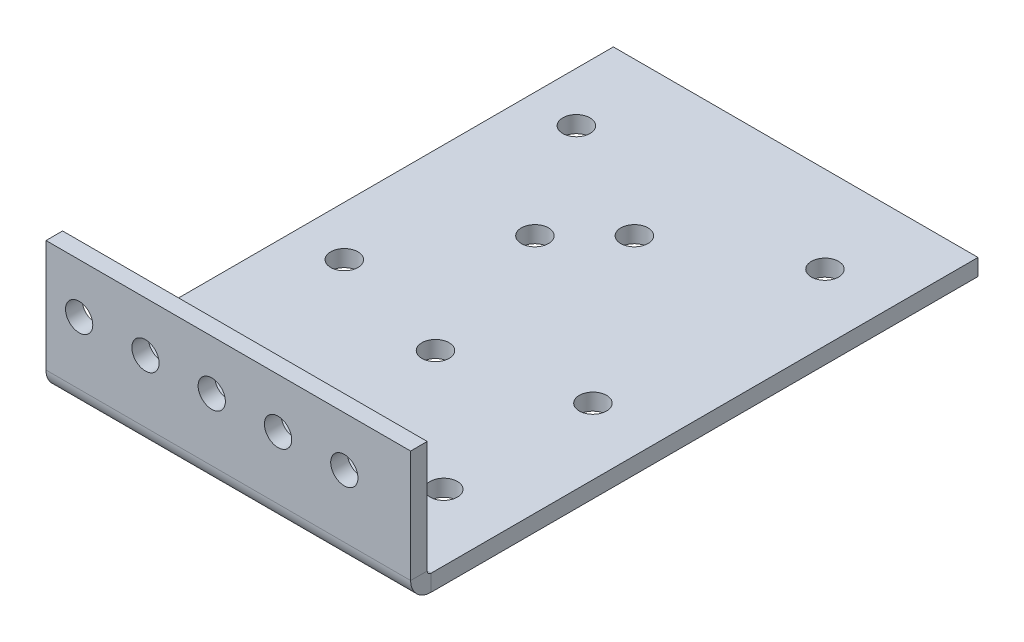
ISO-10303-21;
HEADER;
FILE_DESCRIPTION(('STEP AP214'),'2;1');
FILE_NAME('part.step','',(''),(''),'','','');
FILE_SCHEMA(('AUTOMOTIVE_DESIGN { 1 0 10303 214 1 1 1 1 }'));
ENDSEC;
DATA;
#1=APPLICATION_CONTEXT('core data for automotive mechanical design processes');
#2=APPLICATION_PROTOCOL_DEFINITION('international standard','automotive_design',2000,#1);
#3=PRODUCT_CONTEXT('',#1,'mechanical');
#4=PRODUCT('Part','Part','',(#3));
#5=PRODUCT_RELATED_PRODUCT_CATEGORY('part','',(#4));
#6=PRODUCT_DEFINITION_FORMATION('','',#4);
#7=PRODUCT_DEFINITION_CONTEXT('part definition',#1,'design');
#8=PRODUCT_DEFINITION('design','',#6,#7);
#9=PRODUCT_DEFINITION_SHAPE('','',#8);
#10=(LENGTH_UNIT() NAMED_UNIT(*) SI_UNIT(.MILLI.,.METRE.));
#11=(NAMED_UNIT(*) PLANE_ANGLE_UNIT() SI_UNIT($,.RADIAN.));
#12=(NAMED_UNIT(*) SI_UNIT($,.STERADIAN.) SOLID_ANGLE_UNIT());
#13=UNCERTAINTY_MEASURE_WITH_UNIT(LENGTH_MEASURE(1.E-05),#10,'distance_accuracy_value','');
#14=(GEOMETRIC_REPRESENTATION_CONTEXT(3) GLOBAL_UNCERTAINTY_ASSIGNED_CONTEXT((#13)) GLOBAL_UNIT_ASSIGNED_CONTEXT((#10,
#11,#12)) REPRESENTATION_CONTEXT('',''));
#15=CARTESIAN_POINT('',(0.,0.,0.));
#16=DIRECTION('',(0.,0.,1.));
#17=DIRECTION('',(1.,0.,0.));
#18=AXIS2_PLACEMENT_3D('',#15,#16,#17);
#19=CARTESIAN_POINT('',(0.,-3.175,0.));
#20=DIRECTION('',(-1.,0.,0.));
#21=DIRECTION('',(0.,0.,1.));
#22=AXIS2_PLACEMENT_3D('',#19,#20,#21);
#23=PLANE('',#22);
#24=DIRECTION('',(0.,0.,1.));
#25=VECTOR('',#24,1.);
#26=CARTESIAN_POINT('',(0.,0.,0.));
#27=LINE('',#26,#25);
#28=CARTESIAN_POINT('',(0.,0.,-101.6));
#29=VERTEX_POINT('',#28);
#30=CARTESIAN_POINT('',(0.,0.,3.175));
#31=VERTEX_POINT('',#30);
#32=EDGE_CURVE('E195',#29,#31,#27,.T.);
#33=ORIENTED_EDGE('',*,*,#32,.F.);
#34=DIRECTION('',(0.,1.,0.));
#35=VECTOR('',#34,1.);
#36=CARTESIAN_POINT('',(0.,-3.175,-101.6));
#37=LINE('',#36,#35);
#38=CARTESIAN_POINT('',(0.,-3.175,-101.6));
#39=VERTEX_POINT('',#38);
#40=EDGE_CURVE('E13',#39,#29,#37,.T.);
#41=ORIENTED_EDGE('',*,*,#40,.F.);
#42=DIRECTION('',(0.,0.,1.));
#43=VECTOR('',#42,1.);
#44=CARTESIAN_POINT('',(0.,-3.175,0.));
#45=LINE('',#44,#43);
#46=CARTESIAN_POINT('',(0.,-3.175,3.175));
#47=VERTEX_POINT('',#46);
#48=EDGE_CURVE('E198',#39,#47,#45,.T.);
#49=ORIENTED_EDGE('',*,*,#48,.T.);
#50=DIRECTION('',(0.,-1.,0.));
#51=VECTOR('',#50,1.);
#52=CARTESIAN_POINT('',(0.,0.,3.175));
#53=LINE('',#52,#51);
#54=EDGE_CURVE('E193',#31,#47,#53,.T.);
#55=ORIENTED_EDGE('',*,*,#54,.F.);
#56=EDGE_LOOP('',(#33,#41,#49,#55));
#57=FACE_BOUND('',#56,.T.);
#58=ADVANCED_FACE('F65',(#57),#23,.T.);
#59=CARTESIAN_POINT('',(0.,-3.175,-101.6));
#60=DIRECTION('',(0.,0.,-1.));
#61=DIRECTION('',(-1.,0.,0.));
#62=AXIS2_PLACEMENT_3D('',#59,#60,#61);
#63=PLANE('',#62);
#64=DIRECTION('',(-1.,0.,0.));
#65=VECTOR('',#64,1.);
#66=CARTESIAN_POINT('',(0.,0.,-101.6));
#67=LINE('',#66,#65);
#68=CARTESIAN_POINT('',(69.85,0.,-101.6));
#69=VERTEX_POINT('',#68);
#70=EDGE_CURVE('E201',#69,#29,#67,.T.);
#71=ORIENTED_EDGE('',*,*,#70,.F.);
#72=DIRECTION('',(0.,1.,0.));
#73=VECTOR('',#72,1.);
#74=CARTESIAN_POINT('',(69.85,-3.175,-101.6));
#75=LINE('',#74,#73);
#76=CARTESIAN_POINT('',(69.85,-3.175,-101.6));
#77=VERTEX_POINT('',#76);
#78=EDGE_CURVE('E74',#77,#69,#75,.T.);
#79=ORIENTED_EDGE('',*,*,#78,.F.);
#80=DIRECTION('',(-1.,0.,0.));
#81=VECTOR('',#80,1.);
#82=CARTESIAN_POINT('',(0.,-3.175,-101.6));
#83=LINE('',#82,#81);
#84=EDGE_CURVE('E203',#77,#39,#83,.T.);
#85=ORIENTED_EDGE('',*,*,#84,.T.);
#86=ORIENTED_EDGE('',*,*,#40,.T.);
#87=EDGE_LOOP('',(#71,#79,#85,#86));
#88=FACE_BOUND('',#87,.T.);
#89=ADVANCED_FACE('F330',(#88),#63,.T.);
#90=CARTESIAN_POINT('',(69.85,-3.175,0.));
#91=DIRECTION('',(1.,0.,0.));
#92=DIRECTION('',(0.,0.,-1.));
#93=AXIS2_PLACEMENT_3D('',#90,#91,#92);
#94=PLANE('',#93);
#95=DIRECTION('',(0.,0.,-1.));
#96=VECTOR('',#95,1.);
#97=CARTESIAN_POINT('',(69.85,0.,0.));
#98=LINE('',#97,#96);
#99=CARTESIAN_POINT('',(69.85,0.,3.175));
#100=VERTEX_POINT('',#99);
#101=EDGE_CURVE('E208',#100,#69,#98,.T.);
#102=ORIENTED_EDGE('',*,*,#101,.F.);
#103=DIRECTION('',(0.,-1.,0.));
#104=VECTOR('',#103,1.);
#105=CARTESIAN_POINT('',(69.85,0.,3.175));
#106=LINE('',#105,#104);
#107=CARTESIAN_POINT('',(69.85,-3.175,3.175));
#108=VERTEX_POINT('',#107);
#109=EDGE_CURVE('E182',#100,#108,#106,.T.);
#110=ORIENTED_EDGE('',*,*,#109,.T.);
#111=DIRECTION('',(0.,0.,-1.));
#112=VECTOR('',#111,1.);
#113=CARTESIAN_POINT('',(69.85,-3.175,0.));
#114=LINE('',#113,#112);
#115=EDGE_CURVE('E200',#108,#77,#114,.T.);
#116=ORIENTED_EDGE('',*,*,#115,.T.);
#117=ORIENTED_EDGE('',*,*,#78,.T.);
#118=EDGE_LOOP('',(#102,#110,#116,#117));
#119=FACE_BOUND('',#118,.T.);
#120=ADVANCED_FACE('F335',(#119),#94,.T.);
#121=CARTESIAN_POINT('',(0.,-3.175,0.));
#122=DIRECTION('',(0.,-1.,0.));
#123=DIRECTION('',(0.,0.,-1.));
#124=AXIS2_PLACEMENT_3D('',#121,#122,#123);
#125=PLANE('',#124);
#126=CARTESIAN_POINT('',(6.35000004876061,-3.175,-11.9634000000065));
#127=DIRECTION('',(0.,-1.,0.));
#128=DIRECTION('',(0.,0.,-1.));
#129=AXIS2_PLACEMENT_3D('',#126,#127,#128);
#130=CIRCLE('',#129,2.60985);
#131=CARTESIAN_POINT('',(6.35000004876061,-3.175,-14.5732500000065));
#132=VERTEX_POINT('',#131);
#133=EDGE_CURVE('E247',#132,#132,#130,.T.);
#134=ORIENTED_EDGE('',*,*,#133,.F.);
#135=EDGE_LOOP('',(#134));
#136=FACE_BOUND('',#135,.T.);
#137=CARTESIAN_POINT('',(19.0500000487606,-3.175,-11.9634000000065));
#138=DIRECTION('',(0.,-1.,0.));
#139=DIRECTION('',(0.,0.,-1.));
#140=AXIS2_PLACEMENT_3D('',#137,#138,#139);
#141=CIRCLE('',#140,2.60985);
#142=CARTESIAN_POINT('',(19.0500000487606,-3.175,-14.5732500000065));
#143=VERTEX_POINT('',#142);
#144=EDGE_CURVE('E663',#143,#143,#141,.T.);
#145=ORIENTED_EDGE('',*,*,#144,.F.);
#146=EDGE_LOOP('',(#145));
#147=FACE_BOUND('',#146,.T.);
#148=CARTESIAN_POINT('',(31.7500000487606,-3.175,-11.9634000000065));
#149=DIRECTION('',(0.,-1.,0.));
#150=DIRECTION('',(0.,0.,-1.));
#151=AXIS2_PLACEMENT_3D('',#148,#149,#150);
#152=CIRCLE('',#151,2.60985);
#153=CARTESIAN_POINT('',(31.7500000487606,-3.175,-14.5732500000065));
#154=VERTEX_POINT('',#153);
#155=EDGE_CURVE('E666',#154,#154,#152,.T.);
#156=ORIENTED_EDGE('',*,*,#155,.F.);
#157=EDGE_LOOP('',(#156));
#158=FACE_BOUND('',#157,.T.);
#159=CARTESIAN_POINT('',(44.4500000487606,-3.175,-11.9634000000065));
#160=DIRECTION('',(0.,-1.,0.));
#161=DIRECTION('',(0.,0.,-1.));
#162=AXIS2_PLACEMENT_3D('',#159,#160,#161);
#163=CIRCLE('',#162,2.60985);
#164=CARTESIAN_POINT('',(44.4500000487606,-3.175,-14.5732500000065));
#165=VERTEX_POINT('',#164);
#166=EDGE_CURVE('E670',#165,#165,#163,.T.);
#167=ORIENTED_EDGE('',*,*,#166,.F.);
#168=EDGE_LOOP('',(#167));
#169=FACE_BOUND('',#168,.T.);
#170=CARTESIAN_POINT('',(57.1500000487606,-3.175,-11.9634000000065));
#171=DIRECTION('',(0.,-1.,0.));
#172=DIRECTION('',(0.,0.,-1.));
#173=AXIS2_PLACEMENT_3D('',#170,#171,#172);
#174=CIRCLE('',#173,2.60985);
#175=CARTESIAN_POINT('',(57.1500000487606,-3.175,-14.5732500000065));
#176=VERTEX_POINT('',#175);
#177=EDGE_CURVE('E269',#176,#176,#174,.T.);
#178=ORIENTED_EDGE('',*,*,#177,.F.);
#179=EDGE_LOOP('',(#178));
#180=FACE_BOUND('',#179,.T.);
#181=CARTESIAN_POINT('',(33.3375,-3.175,-34.1884));
#182=DIRECTION('',(0.,-1.,0.));
#183=DIRECTION('',(0.,0.,-1.));
#184=AXIS2_PLACEMENT_3D('',#181,#182,#183);
#185=CIRCLE('',#184,2.60985);
#186=CARTESIAN_POINT('',(33.3375,-3.175,-36.79825));
#187=VERTEX_POINT('',#186);
#188=EDGE_CURVE('E286',#187,#187,#185,.T.);
#189=ORIENTED_EDGE('',*,*,#188,.F.);
#190=EDGE_LOOP('',(#189));
#191=FACE_BOUND('',#190,.T.);
#192=CARTESIAN_POINT('',(23.8125,-3.175,-62.7634000000001));
#193=DIRECTION('',(0.,-1.,0.));
#194=DIRECTION('',(0.,0.,-1.));
#195=AXIS2_PLACEMENT_3D('',#192,#193,#194);
#196=CIRCLE('',#195,2.60985);
#197=CARTESIAN_POINT('',(23.8125,-3.175,-65.3732500000001));
#198=VERTEX_POINT('',#197);
#199=EDGE_CURVE('E233',#198,#198,#196,.T.);
#200=ORIENTED_EDGE('',*,*,#199,.F.);
#201=EDGE_LOOP('',(#200));
#202=FACE_BOUND('',#201,.T.);
#203=CARTESIAN_POINT('',(33.3375,-3.175,-72.2884));
#204=DIRECTION('',(0.,-1.,0.));
#205=DIRECTION('',(0.,0.,-1.));
#206=AXIS2_PLACEMENT_3D('',#203,#204,#205);
#207=CIRCLE('',#206,2.60985);
#208=CARTESIAN_POINT('',(33.3375,-3.175,-74.89825));
#209=VERTEX_POINT('',#208);
#210=EDGE_CURVE('E229',#209,#209,#207,.T.);
#211=ORIENTED_EDGE('',*,*,#210,.F.);
#212=EDGE_LOOP('',(#211));
#213=FACE_BOUND('',#212,.T.);
#214=CARTESIAN_POINT('',(57.15,-3.175,-84.9884));
#215=DIRECTION('',(0.,-1.,0.));
#216=DIRECTION('',(0.,0.,-1.));
#217=AXIS2_PLACEMENT_3D('',#214,#215,#216);
#218=CIRCLE('',#217,2.60985);
#219=CARTESIAN_POINT('',(57.15,-3.175,-87.59825));
#220=VERTEX_POINT('',#219);
#221=EDGE_CURVE('E225',#220,#220,#218,.T.);
#222=ORIENTED_EDGE('',*,*,#221,.F.);
#223=EDGE_LOOP('',(#222));
#224=FACE_BOUND('',#223,.T.);
#225=CARTESIAN_POINT('',(57.15,-3.175,-40.5384));
#226=DIRECTION('',(0.,-1.,0.));
#227=DIRECTION('',(0.,0.,-1.));
#228=AXIS2_PLACEMENT_3D('',#225,#226,#227);
#229=CIRCLE('',#228,2.60985);
#230=CARTESIAN_POINT('',(57.15,-3.175,-43.14825));
#231=VERTEX_POINT('',#230);
#232=EDGE_CURVE('E221',#231,#231,#229,.T.);
#233=ORIENTED_EDGE('',*,*,#232,.F.);
#234=EDGE_LOOP('',(#233));
#235=FACE_BOUND('',#234,.T.);
#236=CARTESIAN_POINT('',(9.52499999999999,-3.175,-40.5384000000001));
#237=DIRECTION('',(0.,-1.,0.));
#238=DIRECTION('',(0.,0.,-1.));
#239=AXIS2_PLACEMENT_3D('',#236,#237,#238);
#240=CIRCLE('',#239,2.60985);
#241=CARTESIAN_POINT('',(9.52499999999999,-3.175,-43.1482500000001));
#242=VERTEX_POINT('',#241);
#243=EDGE_CURVE('E217',#242,#242,#240,.T.);
#244=ORIENTED_EDGE('',*,*,#243,.F.);
#245=EDGE_LOOP('',(#244));
#246=FACE_BOUND('',#245,.T.);
#247=CARTESIAN_POINT('',(9.52499999999999,-3.175,-84.9884));
#248=DIRECTION('',(0.,-1.,0.));
#249=DIRECTION('',(0.,0.,-1.));
#250=AXIS2_PLACEMENT_3D('',#247,#248,#249);
#251=CIRCLE('',#250,2.60985);
#252=CARTESIAN_POINT('',(9.52499999999999,-3.175,-87.59825));
#253=VERTEX_POINT('',#252);
#254=EDGE_CURVE('E216',#253,#253,#251,.T.);
#255=ORIENTED_EDGE('',*,*,#254,.F.);
#256=EDGE_LOOP('',(#255));
#257=FACE_BOUND('',#256,.T.);
#258=ORIENTED_EDGE('',*,*,#48,.F.);
#259=ORIENTED_EDGE('',*,*,#84,.F.);
#260=ORIENTED_EDGE('',*,*,#115,.F.);
#261=DIRECTION('',(1.,0.,0.));
#262=VECTOR('',#261,1.);
#263=CARTESIAN_POINT('',(69.85,-3.175,3.175));
#264=LINE('',#263,#262);
#265=EDGE_CURVE('E177',#108,#47,#264,.F.);
#266=ORIENTED_EDGE('',*,*,#265,.T.);
#267=EDGE_LOOP('',(#258,#259,#260,#266));
#268=FACE_BOUND('',#267,.T.);
#269=ADVANCED_FACE('F346',(#136,#147,#158,#169,#180,#191,#202,#213,#224,#235,#246,#257,#268),
#125,.T.);
#270=CARTESIAN_POINT('',(0.,0.,0.));
#271=DIRECTION('',(0.,-1.,0.));
#272=DIRECTION('',(0.,0.,-1.));
#273=AXIS2_PLACEMENT_3D('',#270,#271,#272);
#274=PLANE('',#273);
#275=CARTESIAN_POINT('',(6.35000004876061,0.,-11.9634000000065));
#276=DIRECTION('',(0.,-1.,0.));
#277=DIRECTION('',(0.,0.,-1.));
#278=AXIS2_PLACEMENT_3D('',#275,#276,#277);
#279=CIRCLE('',#278,2.60985);
#280=CARTESIAN_POINT('',(6.35000004876061,0.,-14.5732500000065));
#281=VERTEX_POINT('',#280);
#282=EDGE_CURVE('E68',#281,#281,#279,.T.);
#283=ORIENTED_EDGE('',*,*,#282,.T.);
#284=EDGE_LOOP('',(#283));
#285=FACE_BOUND('',#284,.T.);
#286=CARTESIAN_POINT('',(19.0500000487606,0.,-11.9634000000065));
#287=DIRECTION('',(0.,-1.,0.));
#288=DIRECTION('',(0.,0.,-1.));
#289=AXIS2_PLACEMENT_3D('',#286,#287,#288);
#290=CIRCLE('',#289,2.60985);
#291=CARTESIAN_POINT('',(19.0500000487606,0.,-14.5732500000065));
#292=VERTEX_POINT('',#291);
#293=EDGE_CURVE('E252',#292,#292,#290,.T.);
#294=ORIENTED_EDGE('',*,*,#293,.T.);
#295=EDGE_LOOP('',(#294));
#296=FACE_BOUND('',#295,.T.);
#297=CARTESIAN_POINT('',(31.7500000487606,0.,-11.9634000000065));
#298=DIRECTION('',(0.,-1.,0.));
#299=DIRECTION('',(0.,0.,-1.));
#300=AXIS2_PLACEMENT_3D('',#297,#298,#299);
#301=CIRCLE('',#300,2.60985);
#302=CARTESIAN_POINT('',(31.7500000487606,0.,-14.5732500000065));
#303=VERTEX_POINT('',#302);
#304=EDGE_CURVE('E250',#303,#303,#301,.T.);
#305=ORIENTED_EDGE('',*,*,#304,.T.);
#306=EDGE_LOOP('',(#305));
#307=FACE_BOUND('',#306,.T.);
#308=CARTESIAN_POINT('',(44.4500000487606,0.,-11.9634000000065));
#309=DIRECTION('',(0.,-1.,0.));
#310=DIRECTION('',(0.,0.,-1.));
#311=AXIS2_PLACEMENT_3D('',#308,#309,#310);
#312=CIRCLE('',#311,2.60985);
#313=CARTESIAN_POINT('',(44.4500000487606,0.,-14.5732500000065));
#314=VERTEX_POINT('',#313);
#315=EDGE_CURVE('E246',#314,#314,#312,.T.);
#316=ORIENTED_EDGE('',*,*,#315,.T.);
#317=EDGE_LOOP('',(#316));
#318=FACE_BOUND('',#317,.T.);
#319=CARTESIAN_POINT('',(57.1500000487606,0.,-11.9634000000065));
#320=DIRECTION('',(0.,-1.,0.));
#321=DIRECTION('',(0.,0.,-1.));
#322=AXIS2_PLACEMENT_3D('',#319,#320,#321);
#323=CIRCLE('',#322,2.60985);
#324=CARTESIAN_POINT('',(57.1500000487606,0.,-14.5732500000065));
#325=VERTEX_POINT('',#324);
#326=EDGE_CURVE('E243',#325,#325,#323,.T.);
#327=ORIENTED_EDGE('',*,*,#326,.T.);
#328=EDGE_LOOP('',(#327));
#329=FACE_BOUND('',#328,.T.);
#330=CARTESIAN_POINT('',(33.3375,0.,-34.1884));
#331=DIRECTION('',(0.,-1.,0.));
#332=DIRECTION('',(0.,0.,-1.));
#333=AXIS2_PLACEMENT_3D('',#330,#331,#332);
#334=CIRCLE('',#333,2.60985);
#335=CARTESIAN_POINT('',(33.3375,0.,-36.79825));
#336=VERTEX_POINT('',#335);
#337=EDGE_CURVE('E289',#336,#336,#334,.T.);
#338=ORIENTED_EDGE('',*,*,#337,.T.);
#339=EDGE_LOOP('',(#338));
#340=FACE_BOUND('',#339,.T.);
#341=CARTESIAN_POINT('',(23.8125,0.,-62.7634000000001));
#342=DIRECTION('',(0.,-1.,0.));
#343=DIRECTION('',(0.,0.,-1.));
#344=AXIS2_PLACEMENT_3D('',#341,#342,#343);
#345=CIRCLE('',#344,2.60985);
#346=CARTESIAN_POINT('',(23.8125,0.,-65.3732500000001));
#347=VERTEX_POINT('',#346);
#348=EDGE_CURVE('E230',#347,#347,#345,.T.);
#349=ORIENTED_EDGE('',*,*,#348,.T.);
#350=EDGE_LOOP('',(#349));
#351=FACE_BOUND('',#350,.T.);
#352=CARTESIAN_POINT('',(33.3375,0.,-72.2884));
#353=DIRECTION('',(0.,-1.,0.));
#354=DIRECTION('',(0.,0.,-1.));
#355=AXIS2_PLACEMENT_3D('',#352,#353,#354);
#356=CIRCLE('',#355,2.60985);
#357=CARTESIAN_POINT('',(33.3375,0.,-74.89825));
#358=VERTEX_POINT('',#357);
#359=EDGE_CURVE('E226',#358,#358,#356,.T.);
#360=ORIENTED_EDGE('',*,*,#359,.T.);
#361=EDGE_LOOP('',(#360));
#362=FACE_BOUND('',#361,.T.);
#363=CARTESIAN_POINT('',(57.15,0.,-84.9884));
#364=DIRECTION('',(0.,-1.,0.));
#365=DIRECTION('',(0.,0.,-1.));
#366=AXIS2_PLACEMENT_3D('',#363,#364,#365);
#367=CIRCLE('',#366,2.60985);
#368=CARTESIAN_POINT('',(57.15,0.,-87.59825));
#369=VERTEX_POINT('',#368);
#370=EDGE_CURVE('E222',#369,#369,#367,.T.);
#371=ORIENTED_EDGE('',*,*,#370,.T.);
#372=EDGE_LOOP('',(#371));
#373=FACE_BOUND('',#372,.T.);
#374=CARTESIAN_POINT('',(57.15,0.,-40.5384));
#375=DIRECTION('',(0.,-1.,0.));
#376=DIRECTION('',(0.,0.,-1.));
#377=AXIS2_PLACEMENT_3D('',#374,#375,#376);
#378=CIRCLE('',#377,2.60985);
#379=CARTESIAN_POINT('',(57.15,0.,-43.14825));
#380=VERTEX_POINT('',#379);
#381=EDGE_CURVE('E218',#380,#380,#378,.T.);
#382=ORIENTED_EDGE('',*,*,#381,.T.);
#383=EDGE_LOOP('',(#382));
#384=FACE_BOUND('',#383,.T.);
#385=CARTESIAN_POINT('',(9.52499999999999,0.,-40.5384000000001));
#386=DIRECTION('',(0.,-1.,0.));
#387=DIRECTION('',(0.,0.,-1.));
#388=AXIS2_PLACEMENT_3D('',#385,#386,#387);
#389=CIRCLE('',#388,2.60985);
#390=CARTESIAN_POINT('',(9.52499999999999,0.,-43.1482500000001));
#391=VERTEX_POINT('',#390);
#392=EDGE_CURVE('E213',#391,#391,#389,.T.);
#393=ORIENTED_EDGE('',*,*,#392,.T.);
#394=EDGE_LOOP('',(#393));
#395=FACE_BOUND('',#394,.T.);
#396=CARTESIAN_POINT('',(9.52499999999999,0.,-84.9884));
#397=DIRECTION('',(0.,-1.,0.));
#398=DIRECTION('',(0.,0.,-1.));
#399=AXIS2_PLACEMENT_3D('',#396,#397,#398);
#400=CIRCLE('',#399,2.60985);
#401=CARTESIAN_POINT('',(9.52499999999999,0.,-87.59825));
#402=VERTEX_POINT('',#401);
#403=EDGE_CURVE('E176',#402,#402,#400,.T.);
#404=ORIENTED_EDGE('',*,*,#403,.T.);
#405=EDGE_LOOP('',(#404));
#406=FACE_BOUND('',#405,.T.);
#407=ORIENTED_EDGE('',*,*,#32,.T.);
#408=DIRECTION('',(1.,0.,0.));
#409=VECTOR('',#408,1.);
#410=CARTESIAN_POINT('',(69.85,0.,3.175));
#411=LINE('',#410,#409);
#412=EDGE_CURVE('E188',#100,#31,#411,.F.);
#413=ORIENTED_EDGE('',*,*,#412,.F.);
#414=ORIENTED_EDGE('',*,*,#101,.T.);
#415=ORIENTED_EDGE('',*,*,#70,.T.);
#416=EDGE_LOOP('',(#407,#413,#414,#415));
#417=FACE_BOUND('',#416,.T.);
#418=ADVANCED_FACE('F342',(#285,#296,#307,#318,#329,#340,#351,#362,#373,#384,#395,#406,#417),
#274,.F.);
#419=CARTESIAN_POINT('',(0.,0.736599999999997,3.175));
#420=DIRECTION('',(-1.,0.,0.));
#421=DIRECTION('',(0.,0.,1.));
#422=AXIS2_PLACEMENT_3D('',#419,#420,#421);
#423=PLANE('',#422);
#424=DIRECTION('',(0.,0.,-1.));
#425=VECTOR('',#424,1.);
#426=CARTESIAN_POINT('',(0.,0.736599999999997,7.0866));
#427=LINE('',#426,#425);
#428=CARTESIAN_POINT('',(0.,0.736599999999997,3.9116));
#429=VERTEX_POINT('',#428);
#430=CARTESIAN_POINT('',(0.,0.736599999999997,7.0866));
#431=VERTEX_POINT('',#430);
#432=EDGE_CURVE('E158',#429,#431,#427,.F.);
#433=ORIENTED_EDGE('',*,*,#432,.F.);
#434=CARTESIAN_POINT('',(0.,0.736599999999997,3.175));
#435=DIRECTION('',(1.,0.,0.));
#436=DIRECTION('',(0.,0.,-1.));
#437=AXIS2_PLACEMENT_3D('',#434,#435,#436);
#438=CIRCLE('',#437,0.7366);
#439=EDGE_CURVE('E185',#31,#429,#438,.F.);
#440=ORIENTED_EDGE('',*,*,#439,.F.);
#441=ORIENTED_EDGE('',*,*,#54,.T.);
#442=CARTESIAN_POINT('',(0.,0.736599999999997,3.175));
#443=DIRECTION('',(1.,0.,0.));
#444=DIRECTION('',(0.,0.,-1.));
#445=AXIS2_PLACEMENT_3D('',#442,#443,#444);
#446=CIRCLE('',#445,3.9116);
#447=EDGE_CURVE('E99',#47,#431,#446,.F.);
#448=ORIENTED_EDGE('',*,*,#447,.T.);
#449=EDGE_LOOP('',(#433,#440,#441,#448));
#450=FACE_BOUND('',#449,.T.);
#451=ADVANCED_FACE('F348',(#450),#423,.T.);
#452=CARTESIAN_POINT('',(69.85,0.736599999999997,3.175));
#453=DIRECTION('',(-1.,0.,0.));
#454=DIRECTION('',(0.,0.,1.));
#455=AXIS2_PLACEMENT_3D('',#452,#453,#454);
#456=PLANE('',#455);
#457=CARTESIAN_POINT('',(69.85,0.736599999999997,3.175));
#458=DIRECTION('',(1.,0.,0.));
#459=DIRECTION('',(0.,0.,-1.));
#460=AXIS2_PLACEMENT_3D('',#457,#458,#459);
#461=CIRCLE('',#460,0.7366);
#462=CARTESIAN_POINT('',(69.85,0.736599999999997,3.9116));
#463=VERTEX_POINT('',#462);
#464=EDGE_CURVE('E190',#463,#100,#461,.T.);
#465=ORIENTED_EDGE('',*,*,#464,.F.);
#466=DIRECTION('',(0.,0.,-1.));
#467=VECTOR('',#466,1.);
#468=CARTESIAN_POINT('',(69.85,0.736599999999997,3.9116));
#469=LINE('',#468,#467);
#470=CARTESIAN_POINT('',(69.85,0.736599999999997,7.0866));
#471=VERTEX_POINT('',#470);
#472=EDGE_CURVE('E170',#463,#471,#469,.F.);
#473=ORIENTED_EDGE('',*,*,#472,.T.);
#474=CARTESIAN_POINT('',(69.85,0.736599999999997,3.175));
#475=DIRECTION('',(1.,0.,0.));
#476=DIRECTION('',(0.,0.,-1.));
#477=AXIS2_PLACEMENT_3D('',#474,#475,#476);
#478=CIRCLE('',#477,3.9116);
#479=EDGE_CURVE('E180',#471,#108,#478,.T.);
#480=ORIENTED_EDGE('',*,*,#479,.T.);
#481=ORIENTED_EDGE('',*,*,#109,.F.);
#482=EDGE_LOOP('',(#465,#473,#480,#481));
#483=FACE_BOUND('',#482,.T.);
#484=ADVANCED_FACE('F316',(#483),#456,.F.);
#485=CARTESIAN_POINT('',(69.85,0.736599999999997,3.175));
#486=DIRECTION('',(1.,0.,0.));
#487=DIRECTION('',(0.,0.,1.));
#488=AXIS2_PLACEMENT_3D('',#485,#486,#487);
#489=CYLINDRICAL_SURFACE('',#488,3.9116);
#490=ORIENTED_EDGE('',*,*,#265,.F.);
#491=ORIENTED_EDGE('',*,*,#479,.F.);
#492=DIRECTION('',(1.,0.,0.));
#493=VECTOR('',#492,1.);
#494=CARTESIAN_POINT('',(0.,0.736599999999997,7.0866));
#495=LINE('',#494,#493);
#496=EDGE_CURVE('E168',#471,#431,#495,.F.);
#497=ORIENTED_EDGE('',*,*,#496,.T.);
#498=ORIENTED_EDGE('',*,*,#447,.F.);
#499=EDGE_LOOP('',(#490,#491,#497,#498));
#500=FACE_BOUND('',#499,.T.);
#501=ADVANCED_FACE('F325',(#500),#489,.T.);
#502=CARTESIAN_POINT('',(69.85,0.736599999999997,3.175));
#503=DIRECTION('',(1.,0.,0.));
#504=DIRECTION('',(0.,0.,1.));
#505=AXIS2_PLACEMENT_3D('',#502,#503,#504);
#506=CYLINDRICAL_SURFACE('',#505,0.7366);
#507=ORIENTED_EDGE('',*,*,#412,.T.);
#508=ORIENTED_EDGE('',*,*,#439,.T.);
#509=DIRECTION('',(1.,0.,0.));
#510=VECTOR('',#509,1.);
#511=CARTESIAN_POINT('',(0.,0.736599999999997,3.9116));
#512=LINE('',#511,#510);
#513=EDGE_CURVE('E173',#429,#463,#512,.T.);
#514=ORIENTED_EDGE('',*,*,#513,.T.);
#515=ORIENTED_EDGE('',*,*,#464,.T.);
#516=EDGE_LOOP('',(#507,#508,#514,#515));
#517=FACE_BOUND('',#516,.T.);
#518=ADVANCED_FACE('F312',(#517),#506,.F.);
#519=CARTESIAN_POINT('',(69.85,22.225,7.0866));
#520=DIRECTION('',(-1.,0.,0.));
#521=DIRECTION('',(0.,0.,1.));
#522=AXIS2_PLACEMENT_3D('',#519,#520,#521);
#523=PLANE('',#522);
#524=ORIENTED_EDGE('',*,*,#472,.F.);
#525=DIRECTION('',(0.,-1.,0.));
#526=VECTOR('',#525,1.);
#527=CARTESIAN_POINT('',(69.85,22.225,3.9116));
#528=LINE('',#527,#526);
#529=CARTESIAN_POINT('',(69.85,22.225,3.9116));
#530=VERTEX_POINT('',#529);
#531=EDGE_CURVE('E166',#463,#530,#528,.F.);
#532=ORIENTED_EDGE('',*,*,#531,.T.);
#533=DIRECTION('',(0.,0.,-1.));
#534=VECTOR('',#533,1.);
#535=CARTESIAN_POINT('',(69.85,22.225,7.0866));
#536=LINE('',#535,#534);
#537=CARTESIAN_POINT('',(69.85,22.225,7.0866));
#538=VERTEX_POINT('',#537);
#539=EDGE_CURVE('E154',#538,#530,#536,.T.);
#540=ORIENTED_EDGE('',*,*,#539,.F.);
#541=DIRECTION('',(0.,1.,0.));
#542=VECTOR('',#541,1.);
#543=CARTESIAN_POINT('',(69.85,0.,7.0866));
#544=LINE('',#543,#542);
#545=EDGE_CURVE('E141',#471,#538,#544,.T.);
#546=ORIENTED_EDGE('',*,*,#545,.F.);
#547=EDGE_LOOP('',(#524,#532,#540,#546));
#548=FACE_BOUND('',#547,.T.);
#549=ADVANCED_FACE('F317',(#548),#523,.F.);
#550=CARTESIAN_POINT('',(0.,0.,7.0866));
#551=DIRECTION('',(1.,0.,0.));
#552=DIRECTION('',(0.,0.,-1.));
#553=AXIS2_PLACEMENT_3D('',#550,#551,#552);
#554=PLANE('',#553);
#555=ORIENTED_EDGE('',*,*,#432,.T.);
#556=DIRECTION('',(0.,-1.,0.));
#557=VECTOR('',#556,1.);
#558=CARTESIAN_POINT('',(0.,0.,7.0866));
#559=LINE('',#558,#557);
#560=CARTESIAN_POINT('',(0.,22.225,7.0866));
#561=VERTEX_POINT('',#560);
#562=EDGE_CURVE('E139',#561,#431,#559,.T.);
#563=ORIENTED_EDGE('',*,*,#562,.F.);
#564=DIRECTION('',(0.,0.,-1.));
#565=VECTOR('',#564,1.);
#566=CARTESIAN_POINT('',(0.,22.225,7.0866));
#567=LINE('',#566,#565);
#568=CARTESIAN_POINT('',(0.,22.225,3.9116));
#569=VERTEX_POINT('',#568);
#570=EDGE_CURVE('E147',#561,#569,#567,.T.);
#571=ORIENTED_EDGE('',*,*,#570,.T.);
#572=DIRECTION('',(0.,1.,0.));
#573=VECTOR('',#572,1.);
#574=CARTESIAN_POINT('',(0.,0.,3.9116));
#575=LINE('',#574,#573);
#576=EDGE_CURVE('E163',#569,#429,#575,.F.);
#577=ORIENTED_EDGE('',*,*,#576,.T.);
#578=EDGE_LOOP('',(#555,#563,#571,#577));
#579=FACE_BOUND('',#578,.T.);
#580=ADVANCED_FACE('F157',(#579),#554,.F.);
#581=CARTESIAN_POINT('',(0.,0.,7.0866));
#582=DIRECTION('',(0.,0.,-1.));
#583=DIRECTION('',(-1.,0.,0.));
#584=AXIS2_PLACEMENT_3D('',#581,#582,#583);
#585=PLANE('',#584);
#586=CARTESIAN_POINT('',(6.3499999999993,12.6999999999988,7.0866));
#587=DIRECTION('',(0.,0.,1.));
#588=DIRECTION('',(1.,0.,0.));
#589=AXIS2_PLACEMENT_3D('',#586,#587,#588);
#590=CIRCLE('',#589,2.60985);
#591=CARTESIAN_POINT('',(8.9598499999993,12.6999999999988,7.0866));
#592=VERTEX_POINT('',#591);
#593=EDGE_CURVE('E257',#592,#592,#590,.T.);
#594=ORIENTED_EDGE('',*,*,#593,.F.);
#595=EDGE_LOOP('',(#594));
#596=FACE_BOUND('',#595,.T.);
#597=CARTESIAN_POINT('',(19.0499999999993,12.6999999999987,7.0866));
#598=DIRECTION('',(0.,0.,1.));
#599=DIRECTION('',(1.,0.,0.));
#600=AXIS2_PLACEMENT_3D('',#597,#598,#599);
#601=CIRCLE('',#600,2.60985);
#602=CARTESIAN_POINT('',(21.6598499999993,12.6999999999987,7.0866));
#603=VERTEX_POINT('',#602);
#604=EDGE_CURVE('E266',#603,#603,#601,.T.);
#605=ORIENTED_EDGE('',*,*,#604,.F.);
#606=EDGE_LOOP('',(#605));
#607=FACE_BOUND('',#606,.T.);
#608=CARTESIAN_POINT('',(31.7499999999993,12.6999999999987,7.0866));
#609=DIRECTION('',(0.,0.,1.));
#610=DIRECTION('',(1.,0.,0.));
#611=AXIS2_PLACEMENT_3D('',#608,#609,#610);
#612=CIRCLE('',#611,2.60985);
#613=CARTESIAN_POINT('',(34.3598499999993,12.6999999999987,7.0866));
#614=VERTEX_POINT('',#613);
#615=EDGE_CURVE('E242',#614,#614,#612,.T.);
#616=ORIENTED_EDGE('',*,*,#615,.F.);
#617=EDGE_LOOP('',(#616));
#618=FACE_BOUND('',#617,.T.);
#619=CARTESIAN_POINT('',(44.4499999999993,12.6999999999986,7.0866));
#620=DIRECTION('',(0.,0.,1.));
#621=DIRECTION('',(1.,0.,0.));
#622=AXIS2_PLACEMENT_3D('',#619,#620,#621);
#623=CIRCLE('',#622,2.60985);
#624=CARTESIAN_POINT('',(47.0598499999993,12.6999999999986,7.0866));
#625=VERTEX_POINT('',#624);
#626=EDGE_CURVE('E238',#625,#625,#623,.T.);
#627=ORIENTED_EDGE('',*,*,#626,.F.);
#628=EDGE_LOOP('',(#627));
#629=FACE_BOUND('',#628,.T.);
#630=CARTESIAN_POINT('',(57.1499999999993,12.6999999999985,7.0866));
#631=DIRECTION('',(0.,0.,1.));
#632=DIRECTION('',(1.,0.,0.));
#633=AXIS2_PLACEMENT_3D('',#630,#631,#632);
#634=CIRCLE('',#633,2.60985);
#635=CARTESIAN_POINT('',(59.7598499999993,12.6999999999985,7.0866));
#636=VERTEX_POINT('',#635);
#637=EDGE_CURVE('E237',#636,#636,#634,.T.);
#638=ORIENTED_EDGE('',*,*,#637,.F.);
#639=EDGE_LOOP('',(#638));
#640=FACE_BOUND('',#639,.T.);
#641=ORIENTED_EDGE('',*,*,#496,.F.);
#642=ORIENTED_EDGE('',*,*,#545,.T.);
#643=DIRECTION('',(-1.,0.,0.));
#644=VECTOR('',#643,1.);
#645=CARTESIAN_POINT('',(0.,22.225,7.0866));
#646=LINE('',#645,#644);
#647=EDGE_CURVE('E134',#538,#561,#646,.T.);
#648=ORIENTED_EDGE('',*,*,#647,.T.);
#649=ORIENTED_EDGE('',*,*,#562,.T.);
#650=EDGE_LOOP('',(#641,#642,#648,#649));
#651=FACE_BOUND('',#650,.T.);
#652=ADVANCED_FACE('F137',(#596,#607,#618,#629,#640,#651),#585,.F.);
#653=CARTESIAN_POINT('',(0.,0.,3.9116));
#654=DIRECTION('',(0.,0.,-1.));
#655=DIRECTION('',(-1.,0.,0.));
#656=AXIS2_PLACEMENT_3D('',#653,#654,#655);
#657=PLANE('',#656);
#658=CARTESIAN_POINT('',(6.3499999999993,12.6999999999988,3.9116));
#659=DIRECTION('',(0.,0.,-1.));
#660=DIRECTION('',(-1.,0.,0.));
#661=AXIS2_PLACEMENT_3D('',#658,#659,#660);
#662=CIRCLE('',#661,2.60984999999999);
#663=CARTESIAN_POINT('',(3.74014999999931,12.6999999999988,3.9116));
#664=VERTEX_POINT('',#663);
#665=EDGE_CURVE('E261',#664,#664,#662,.T.);
#666=ORIENTED_EDGE('',*,*,#665,.F.);
#667=EDGE_LOOP('',(#666));
#668=FACE_BOUND('',#667,.T.);
#669=CARTESIAN_POINT('',(19.0499999999993,12.6999999999987,3.9116));
#670=DIRECTION('',(0.,0.,-1.));
#671=DIRECTION('',(-1.,0.,0.));
#672=AXIS2_PLACEMENT_3D('',#669,#670,#671);
#673=CIRCLE('',#672,2.60984999999999);
#674=CARTESIAN_POINT('',(16.4401499999993,12.6999999999987,3.9116));
#675=VERTEX_POINT('',#674);
#676=EDGE_CURVE('E274',#675,#675,#673,.T.);
#677=ORIENTED_EDGE('',*,*,#676,.F.);
#678=EDGE_LOOP('',(#677));
#679=FACE_BOUND('',#678,.T.);
#680=CARTESIAN_POINT('',(31.7499999999993,12.6999999999987,3.9116));
#681=DIRECTION('',(0.,0.,-1.));
#682=DIRECTION('',(-1.,0.,0.));
#683=AXIS2_PLACEMENT_3D('',#680,#681,#682);
#684=CIRCLE('',#683,2.60984999999999);
#685=CARTESIAN_POINT('',(29.1401499999993,12.6999999999987,3.9116));
#686=VERTEX_POINT('',#685);
#687=EDGE_CURVE('E239',#686,#686,#684,.T.);
#688=ORIENTED_EDGE('',*,*,#687,.F.);
#689=EDGE_LOOP('',(#688));
#690=FACE_BOUND('',#689,.T.);
#691=CARTESIAN_POINT('',(44.4499999999993,12.6999999999986,3.9116));
#692=DIRECTION('',(0.,0.,-1.));
#693=DIRECTION('',(-1.,0.,0.));
#694=AXIS2_PLACEMENT_3D('',#691,#692,#693);
#695=CIRCLE('',#694,2.60984999999999);
#696=CARTESIAN_POINT('',(41.8401499999993,12.6999999999986,3.9116));
#697=VERTEX_POINT('',#696);
#698=EDGE_CURVE('E234',#697,#697,#695,.T.);
#699=ORIENTED_EDGE('',*,*,#698,.F.);
#700=EDGE_LOOP('',(#699));
#701=FACE_BOUND('',#700,.T.);
#702=CARTESIAN_POINT('',(57.1499999999993,12.6999999999985,3.9116));
#703=DIRECTION('',(0.,0.,-1.));
#704=DIRECTION('',(-1.,0.,0.));
#705=AXIS2_PLACEMENT_3D('',#702,#703,#704);
#706=CIRCLE('',#705,2.60984999999999);
#707=CARTESIAN_POINT('',(54.5401499999993,12.6999999999985,3.9116));
#708=VERTEX_POINT('',#707);
#709=EDGE_CURVE('E283',#708,#708,#706,.T.);
#710=ORIENTED_EDGE('',*,*,#709,.F.);
#711=EDGE_LOOP('',(#710));
#712=FACE_BOUND('',#711,.T.);
#713=ORIENTED_EDGE('',*,*,#531,.F.);
#714=ORIENTED_EDGE('',*,*,#513,.F.);
#715=ORIENTED_EDGE('',*,*,#576,.F.);
#716=DIRECTION('',(1.,0.,0.));
#717=VECTOR('',#716,1.);
#718=CARTESIAN_POINT('',(0.,22.225,3.9116));
#719=LINE('',#718,#717);
#720=EDGE_CURVE('E150',#530,#569,#719,.F.);
#721=ORIENTED_EDGE('',*,*,#720,.F.);
#722=EDGE_LOOP('',(#713,#714,#715,#721));
#723=FACE_BOUND('',#722,.T.);
#724=ADVANCED_FACE('F308',(#668,#679,#690,#701,#712,#723),#657,.T.);
#725=CARTESIAN_POINT('',(0.,22.225,7.0866));
#726=DIRECTION('',(0.,-1.,0.));
#727=DIRECTION('',(0.,0.,-1.));
#728=AXIS2_PLACEMENT_3D('',#725,#726,#727);
#729=PLANE('',#728);
#730=ORIENTED_EDGE('',*,*,#720,.T.);
#731=ORIENTED_EDGE('',*,*,#570,.F.);
#732=ORIENTED_EDGE('',*,*,#647,.F.);
#733=ORIENTED_EDGE('',*,*,#539,.T.);
#734=EDGE_LOOP('',(#730,#731,#732,#733));
#735=FACE_BOUND('',#734,.T.);
#736=ADVANCED_FACE('F148',(#735),#729,.F.);
#737=CARTESIAN_POINT('',(9.52499999999999,-3.175,-84.9884));
#738=DIRECTION('',(0.,-1.,0.));
#739=DIRECTION('',(0.,0.,-1.));
#740=AXIS2_PLACEMENT_3D('',#737,#738,#739);
#741=CYLINDRICAL_SURFACE('',#740,2.60985);
#742=ORIENTED_EDGE('',*,*,#254,.T.);
#743=EDGE_LOOP('',(#742));
#744=FACE_BOUND('',#743,.T.);
#745=ORIENTED_EDGE('',*,*,#403,.F.);
#746=EDGE_LOOP('',(#745));
#747=FACE_BOUND('',#746,.T.);
#748=ADVANCED_FACE('F442',(#744,#747),#741,.F.);
#749=CARTESIAN_POINT('',(9.52499999999999,-3.175,-40.5384000000001));
#750=DIRECTION('',(0.,-1.,0.));
#751=DIRECTION('',(0.,0.,-1.));
#752=AXIS2_PLACEMENT_3D('',#749,#750,#751);
#753=CYLINDRICAL_SURFACE('',#752,2.60985);
#754=ORIENTED_EDGE('',*,*,#243,.T.);
#755=EDGE_LOOP('',(#754));
#756=FACE_BOUND('',#755,.T.);
#757=ORIENTED_EDGE('',*,*,#392,.F.);
#758=EDGE_LOOP('',(#757));
#759=FACE_BOUND('',#758,.T.);
#760=ADVANCED_FACE('F451',(#756,#759),#753,.F.);
#761=CARTESIAN_POINT('',(57.15,-3.175,-40.5384));
#762=DIRECTION('',(0.,-1.,0.));
#763=DIRECTION('',(0.,0.,-1.));
#764=AXIS2_PLACEMENT_3D('',#761,#762,#763);
#765=CYLINDRICAL_SURFACE('',#764,2.60985);
#766=ORIENTED_EDGE('',*,*,#232,.T.);
#767=EDGE_LOOP('',(#766));
#768=FACE_BOUND('',#767,.T.);
#769=ORIENTED_EDGE('',*,*,#381,.F.);
#770=EDGE_LOOP('',(#769));
#771=FACE_BOUND('',#770,.T.);
#772=ADVANCED_FACE('F461',(#768,#771),#765,.F.);
#773=CARTESIAN_POINT('',(57.15,-3.175,-84.9884));
#774=DIRECTION('',(0.,-1.,0.));
#775=DIRECTION('',(0.,0.,-1.));
#776=AXIS2_PLACEMENT_3D('',#773,#774,#775);
#777=CYLINDRICAL_SURFACE('',#776,2.60985);
#778=ORIENTED_EDGE('',*,*,#221,.T.);
#779=EDGE_LOOP('',(#778));
#780=FACE_BOUND('',#779,.T.);
#781=ORIENTED_EDGE('',*,*,#370,.F.);
#782=EDGE_LOOP('',(#781));
#783=FACE_BOUND('',#782,.T.);
#784=ADVANCED_FACE('F471',(#780,#783),#777,.F.);
#785=CARTESIAN_POINT('',(33.3375,-3.175,-72.2884));
#786=DIRECTION('',(0.,-1.,0.));
#787=DIRECTION('',(0.,0.,-1.));
#788=AXIS2_PLACEMENT_3D('',#785,#786,#787);
#789=CYLINDRICAL_SURFACE('',#788,2.60985);
#790=ORIENTED_EDGE('',*,*,#210,.T.);
#791=EDGE_LOOP('',(#790));
#792=FACE_BOUND('',#791,.T.);
#793=ORIENTED_EDGE('',*,*,#359,.F.);
#794=EDGE_LOOP('',(#793));
#795=FACE_BOUND('',#794,.T.);
#796=ADVANCED_FACE('F481',(#792,#795),#789,.F.);
#797=CARTESIAN_POINT('',(23.8125,-3.175,-62.7634000000001));
#798=DIRECTION('',(0.,-1.,0.));
#799=DIRECTION('',(0.,0.,-1.));
#800=AXIS2_PLACEMENT_3D('',#797,#798,#799);
#801=CYLINDRICAL_SURFACE('',#800,2.60985);
#802=ORIENTED_EDGE('',*,*,#199,.T.);
#803=EDGE_LOOP('',(#802));
#804=FACE_BOUND('',#803,.T.);
#805=ORIENTED_EDGE('',*,*,#348,.F.);
#806=EDGE_LOOP('',(#805));
#807=FACE_BOUND('',#806,.T.);
#808=ADVANCED_FACE('F491',(#804,#807),#801,.F.);
#809=CARTESIAN_POINT('',(33.3375,-3.175,-34.1884));
#810=DIRECTION('',(0.,-1.,0.));
#811=DIRECTION('',(0.,0.,-1.));
#812=AXIS2_PLACEMENT_3D('',#809,#810,#811);
#813=CYLINDRICAL_SURFACE('',#812,2.60985);
#814=ORIENTED_EDGE('',*,*,#188,.T.);
#815=EDGE_LOOP('',(#814));
#816=FACE_BOUND('',#815,.T.);
#817=ORIENTED_EDGE('',*,*,#337,.F.);
#818=EDGE_LOOP('',(#817));
#819=FACE_BOUND('',#818,.T.);
#820=ADVANCED_FACE('F501',(#816,#819),#813,.F.);
#821=CARTESIAN_POINT('',(57.1499999999993,12.6999999999985,7.0866));
#822=DIRECTION('',(0.,0.,1.));
#823=DIRECTION('',(1.,0.,0.));
#824=AXIS2_PLACEMENT_3D('',#821,#822,#823);
#825=CYLINDRICAL_SURFACE('',#824,2.60984999999999);
#826=ORIENTED_EDGE('',*,*,#709,.T.);
#827=EDGE_LOOP('',(#826));
#828=FACE_BOUND('',#827,.T.);
#829=ORIENTED_EDGE('',*,*,#637,.T.);
#830=EDGE_LOOP('',(#829));
#831=FACE_BOUND('',#830,.T.);
#832=ADVANCED_FACE('F510',(#828,#831),#825,.F.);
#833=CARTESIAN_POINT('',(44.4499999999993,12.6999999999986,7.0866));
#834=DIRECTION('',(0.,0.,1.));
#835=DIRECTION('',(1.,0.,0.));
#836=AXIS2_PLACEMENT_3D('',#833,#834,#835);
#837=CYLINDRICAL_SURFACE('',#836,2.60984999999999);
#838=ORIENTED_EDGE('',*,*,#698,.T.);
#839=EDGE_LOOP('',(#838));
#840=FACE_BOUND('',#839,.T.);
#841=ORIENTED_EDGE('',*,*,#626,.T.);
#842=EDGE_LOOP('',(#841));
#843=FACE_BOUND('',#842,.T.);
#844=ADVANCED_FACE('F519',(#840,#843),#837,.F.);
#845=CARTESIAN_POINT('',(31.7499999999993,12.6999999999987,7.0866));
#846=DIRECTION('',(0.,0.,1.));
#847=DIRECTION('',(1.,0.,0.));
#848=AXIS2_PLACEMENT_3D('',#845,#846,#847);
#849=CYLINDRICAL_SURFACE('',#848,2.60984999999999);
#850=ORIENTED_EDGE('',*,*,#687,.T.);
#851=EDGE_LOOP('',(#850));
#852=FACE_BOUND('',#851,.T.);
#853=ORIENTED_EDGE('',*,*,#615,.T.);
#854=EDGE_LOOP('',(#853));
#855=FACE_BOUND('',#854,.T.);
#856=ADVANCED_FACE('F529',(#852,#855),#849,.F.);
#857=CARTESIAN_POINT('',(19.0499999999993,12.6999999999987,7.0866));
#858=DIRECTION('',(0.,0.,1.));
#859=DIRECTION('',(1.,0.,0.));
#860=AXIS2_PLACEMENT_3D('',#857,#858,#859);
#861=CYLINDRICAL_SURFACE('',#860,2.60984999999999);
#862=ORIENTED_EDGE('',*,*,#676,.T.);
#863=EDGE_LOOP('',(#862));
#864=FACE_BOUND('',#863,.T.);
#865=ORIENTED_EDGE('',*,*,#604,.T.);
#866=EDGE_LOOP('',(#865));
#867=FACE_BOUND('',#866,.T.);
#868=ADVANCED_FACE('F539',(#864,#867),#861,.F.);
#869=CARTESIAN_POINT('',(6.3499999999993,12.6999999999988,7.0866));
#870=DIRECTION('',(0.,0.,1.));
#871=DIRECTION('',(1.,0.,0.));
#872=AXIS2_PLACEMENT_3D('',#869,#870,#871);
#873=CYLINDRICAL_SURFACE('',#872,2.60984999999999);
#874=ORIENTED_EDGE('',*,*,#665,.T.);
#875=EDGE_LOOP('',(#874));
#876=FACE_BOUND('',#875,.T.);
#877=ORIENTED_EDGE('',*,*,#593,.T.);
#878=EDGE_LOOP('',(#877));
#879=FACE_BOUND('',#878,.T.);
#880=ADVANCED_FACE('F549',(#876,#879),#873,.F.);
#881=CARTESIAN_POINT('',(57.1500000487606,22.225,-11.9634000000065));
#882=DIRECTION('',(0.,-1.,0.));
#883=DIRECTION('',(0.,0.,-1.));
#884=AXIS2_PLACEMENT_3D('',#881,#882,#883);
#885=CYLINDRICAL_SURFACE('',#884,2.60985);
#886=ORIENTED_EDGE('',*,*,#177,.T.);
#887=EDGE_LOOP('',(#886));
#888=FACE_BOUND('',#887,.T.);
#889=ORIENTED_EDGE('',*,*,#326,.F.);
#890=EDGE_LOOP('',(#889));
#891=FACE_BOUND('',#890,.T.);
#892=ADVANCED_FACE('F559',(#888,#891),#885,.F.);
#893=CARTESIAN_POINT('',(44.4500000487606,22.225,-11.9634000000065));
#894=DIRECTION('',(0.,-1.,0.));
#895=DIRECTION('',(0.,0.,-1.));
#896=AXIS2_PLACEMENT_3D('',#893,#894,#895);
#897=CYLINDRICAL_SURFACE('',#896,2.60985);
#898=ORIENTED_EDGE('',*,*,#166,.T.);
#899=EDGE_LOOP('',(#898));
#900=FACE_BOUND('',#899,.T.);
#901=ORIENTED_EDGE('',*,*,#315,.F.);
#902=EDGE_LOOP('',(#901));
#903=FACE_BOUND('',#902,.T.);
#904=ADVANCED_FACE('F569',(#900,#903),#897,.F.);
#905=CARTESIAN_POINT('',(31.7500000487606,22.225,-11.9634000000065));
#906=DIRECTION('',(0.,-1.,0.));
#907=DIRECTION('',(0.,0.,-1.));
#908=AXIS2_PLACEMENT_3D('',#905,#906,#907);
#909=CYLINDRICAL_SURFACE('',#908,2.60985);
#910=ORIENTED_EDGE('',*,*,#155,.T.);
#911=EDGE_LOOP('',(#910));
#912=FACE_BOUND('',#911,.T.);
#913=ORIENTED_EDGE('',*,*,#304,.F.);
#914=EDGE_LOOP('',(#913));
#915=FACE_BOUND('',#914,.T.);
#916=ADVANCED_FACE('F580',(#912,#915),#909,.F.);
#917=CARTESIAN_POINT('',(19.0500000487606,22.225,-11.9634000000065));
#918=DIRECTION('',(0.,-1.,0.));
#919=DIRECTION('',(0.,0.,-1.));
#920=AXIS2_PLACEMENT_3D('',#917,#918,#919);
#921=CYLINDRICAL_SURFACE('',#920,2.60985);
#922=ORIENTED_EDGE('',*,*,#144,.T.);
#923=EDGE_LOOP('',(#922));
#924=FACE_BOUND('',#923,.T.);
#925=ORIENTED_EDGE('',*,*,#293,.F.);
#926=EDGE_LOOP('',(#925));
#927=FACE_BOUND('',#926,.T.);
#928=ADVANCED_FACE('F591',(#924,#927),#921,.F.);
#929=CARTESIAN_POINT('',(6.35000004876061,22.225,-11.9634000000065));
#930=DIRECTION('',(0.,-1.,0.));
#931=DIRECTION('',(0.,0.,-1.));
#932=AXIS2_PLACEMENT_3D('',#929,#930,#931);
#933=CYLINDRICAL_SURFACE('',#932,2.60985);
#934=ORIENTED_EDGE('',*,*,#133,.T.);
#935=EDGE_LOOP('',(#934));
#936=FACE_BOUND('',#935,.T.);
#937=ORIENTED_EDGE('',*,*,#282,.F.);
#938=EDGE_LOOP('',(#937));
#939=FACE_BOUND('',#938,.T.);
#940=ADVANCED_FACE('F602',(#936,#939),#933,.F.);
#941=CLOSED_SHELL('',(#58,#89,#120,#269,#418,#451,#484,#501,#518,#549,#580,#652,#724,#736,#748,
#760,#772,#784,#796,#808,#820,#832,#844,#856,#868,#880,#892,#904,#916,#928,#940));
#942=MANIFOLD_SOLID_BREP('B2',#941);
#943=ADVANCED_BREP_SHAPE_REPRESENTATION('',(#18,#942),#14);
#944=SHAPE_DEFINITION_REPRESENTATION(#9,#943);
ENDSEC;
END-ISO-10303-21;
